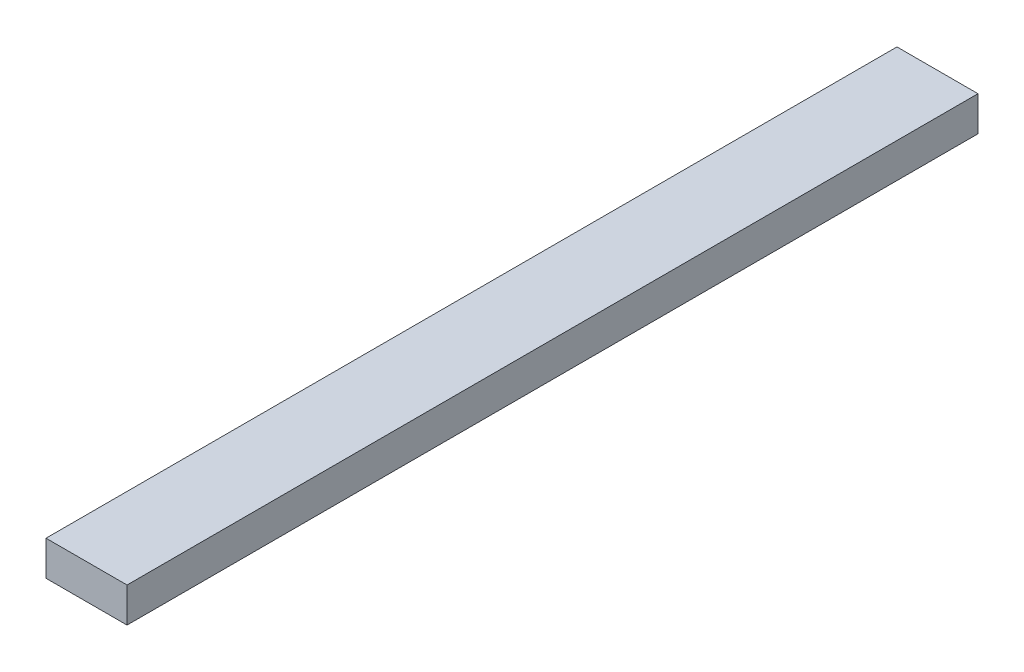
ISO-10303-21;
HEADER;
FILE_DESCRIPTION(('STEP AP214'),'2;1');
FILE_NAME('part.step','',(''),(''),'','','');
FILE_SCHEMA(('AUTOMOTIVE_DESIGN { 1 0 10303 214 1 1 1 1 }'));
ENDSEC;
DATA;
#1=APPLICATION_CONTEXT('core data for automotive mechanical design processes');
#2=APPLICATION_PROTOCOL_DEFINITION('international standard','automotive_design',2000,#1);
#3=PRODUCT_CONTEXT('',#1,'mechanical');
#4=PRODUCT('Part','Part','',(#3));
#5=PRODUCT_RELATED_PRODUCT_CATEGORY('part','',(#4));
#6=PRODUCT_DEFINITION_FORMATION('','',#4);
#7=PRODUCT_DEFINITION_CONTEXT('part definition',#1,'design');
#8=PRODUCT_DEFINITION('design','',#6,#7);
#9=PRODUCT_DEFINITION_SHAPE('','',#8);
#10=(LENGTH_UNIT() NAMED_UNIT(*) SI_UNIT(.MILLI.,.METRE.));
#11=(NAMED_UNIT(*) PLANE_ANGLE_UNIT() SI_UNIT($,.RADIAN.));
#12=(NAMED_UNIT(*) SI_UNIT($,.STERADIAN.) SOLID_ANGLE_UNIT());
#13=UNCERTAINTY_MEASURE_WITH_UNIT(LENGTH_MEASURE(1.E-05),#10,'distance_accuracy_value','');
#14=(GEOMETRIC_REPRESENTATION_CONTEXT(3) GLOBAL_UNCERTAINTY_ASSIGNED_CONTEXT((#13)) GLOBAL_UNIT_ASSIGNED_CONTEXT((#10,
#11,#12)) REPRESENTATION_CONTEXT('',''));
#15=CARTESIAN_POINT('',(0.,0.,0.));
#16=DIRECTION('',(0.,0.,1.));
#17=DIRECTION('',(1.,0.,0.));
#18=AXIS2_PLACEMENT_3D('',#15,#16,#17);
#19=CARTESIAN_POINT('',(-58.8507871435938,47.0280870609555,933.45));
#20=DIRECTION('',(1.,0.,0.));
#21=DIRECTION('',(0.,0.,-1.));
#22=AXIS2_PLACEMENT_3D('',#19,#20,#21);
#23=PLANE('',#22);
#24=DIRECTION('',(0.,-1.,0.));
#25=VECTOR('',#24,1.);
#26=CARTESIAN_POINT('',(-58.8507871435938,47.0280870609555,0.));
#27=LINE('',#26,#25);
#28=CARTESIAN_POINT('',(-58.8507871435938,47.0280870609555,0.));
#29=VERTEX_POINT('',#28);
#30=CARTESIAN_POINT('',(-58.8507871435938,8.92808706095547,0.));
#31=VERTEX_POINT('',#30);
#32=EDGE_CURVE('E95',#29,#31,#27,.T.);
#33=ORIENTED_EDGE('',*,*,#32,.T.);
#34=DIRECTION('',(0.,0.,-1.));
#35=VECTOR('',#34,1.);
#36=CARTESIAN_POINT('',(-58.8507871435938,8.92808706095547,933.45));
#37=LINE('',#36,#35);
#38=CARTESIAN_POINT('',(-58.8507871435938,8.92808706095547,933.45));
#39=VERTEX_POINT('',#38);
#40=EDGE_CURVE('E11',#39,#31,#37,.T.);
#41=ORIENTED_EDGE('',*,*,#40,.F.);
#42=DIRECTION('',(0.,-1.,0.));
#43=VECTOR('',#42,1.);
#44=CARTESIAN_POINT('',(-58.8507871435938,47.0280870609555,933.45));
#45=LINE('',#44,#43);
#46=CARTESIAN_POINT('',(-58.8507871435938,47.0280870609555,933.45));
#47=VERTEX_POINT('',#46);
#48=EDGE_CURVE('E83',#47,#39,#45,.T.);
#49=ORIENTED_EDGE('',*,*,#48,.F.);
#50=DIRECTION('',(0.,0.,-1.));
#51=VECTOR('',#50,1.);
#52=CARTESIAN_POINT('',(-58.8507871435938,47.0280870609555,933.45));
#53=LINE('',#52,#51);
#54=EDGE_CURVE('E91',#47,#29,#53,.T.);
#55=ORIENTED_EDGE('',*,*,#54,.T.);
#56=EDGE_LOOP('',(#33,#41,#49,#55));
#57=FACE_BOUND('',#56,.T.);
#58=ADVANCED_FACE('F32',(#57),#23,.F.);
#59=CARTESIAN_POINT('',(-58.8507871435938,8.92808706095547,933.45));
#60=DIRECTION('',(0.,1.,0.));
#61=DIRECTION('',(0.,0.,1.));
#62=AXIS2_PLACEMENT_3D('',#59,#60,#61);
#63=PLANE('',#62);
#64=DIRECTION('',(1.,0.,0.));
#65=VECTOR('',#64,1.);
#66=CARTESIAN_POINT('',(-58.8507871435938,8.92808706095547,0.));
#67=LINE('',#66,#65);
#68=CARTESIAN_POINT('',(30.0492128564062,8.92808706095547,0.));
#69=VERTEX_POINT('',#68);
#70=EDGE_CURVE('E87',#31,#69,#67,.T.);
#71=ORIENTED_EDGE('',*,*,#70,.T.);
#72=DIRECTION('',(0.,0.,-1.));
#73=VECTOR('',#72,1.);
#74=CARTESIAN_POINT('',(30.0492128564062,8.92808706095547,933.45));
#75=LINE('',#74,#73);
#76=CARTESIAN_POINT('',(30.0492128564062,8.92808706095547,933.45));
#77=VERTEX_POINT('',#76);
#78=EDGE_CURVE('E40',#77,#69,#75,.T.);
#79=ORIENTED_EDGE('',*,*,#78,.F.);
#80=DIRECTION('',(1.,0.,0.));
#81=VECTOR('',#80,1.);
#82=CARTESIAN_POINT('',(-58.8507871435938,8.92808706095547,933.45));
#83=LINE('',#82,#81);
#84=EDGE_CURVE('E78',#39,#77,#83,.T.);
#85=ORIENTED_EDGE('',*,*,#84,.F.);
#86=ORIENTED_EDGE('',*,*,#40,.T.);
#87=EDGE_LOOP('',(#71,#79,#85,#86));
#88=FACE_BOUND('',#87,.T.);
#89=ADVANCED_FACE('F86',(#88),#63,.F.);
#90=CARTESIAN_POINT('',(30.0492128564062,47.0280870609555,933.45));
#91=DIRECTION('',(-1.,0.,0.));
#92=DIRECTION('',(0.,0.,1.));
#93=AXIS2_PLACEMENT_3D('',#90,#91,#92);
#94=PLANE('',#93);
#95=DIRECTION('',(0.,1.,0.));
#96=VECTOR('',#95,1.);
#97=CARTESIAN_POINT('',(30.0492128564062,47.0280870609555,0.));
#98=LINE('',#97,#96);
#99=CARTESIAN_POINT('',(30.0492128564062,47.0280870609555,0.));
#100=VERTEX_POINT('',#99);
#101=EDGE_CURVE('E65',#69,#100,#98,.T.);
#102=ORIENTED_EDGE('',*,*,#101,.T.);
#103=DIRECTION('',(0.,0.,-1.));
#104=VECTOR('',#103,1.);
#105=CARTESIAN_POINT('',(30.0492128564062,47.0280870609555,933.45));
#106=LINE('',#105,#104);
#107=CARTESIAN_POINT('',(30.0492128564062,47.0280870609555,933.45));
#108=VERTEX_POINT('',#107);
#109=EDGE_CURVE('E88',#108,#100,#106,.T.);
#110=ORIENTED_EDGE('',*,*,#109,.F.);
#111=DIRECTION('',(0.,1.,0.));
#112=VECTOR('',#111,1.);
#113=CARTESIAN_POINT('',(30.0492128564062,47.0280870609555,933.45));
#114=LINE('',#113,#112);
#115=EDGE_CURVE('E81',#77,#108,#114,.T.);
#116=ORIENTED_EDGE('',*,*,#115,.F.);
#117=ORIENTED_EDGE('',*,*,#78,.T.);
#118=EDGE_LOOP('',(#102,#110,#116,#117));
#119=FACE_BOUND('',#118,.T.);
#120=ADVANCED_FACE('F89',(#119),#94,.F.);
#121=CARTESIAN_POINT('',(-58.8507871435938,47.0280870609555,933.45));
#122=DIRECTION('',(0.,-1.,0.));
#123=DIRECTION('',(0.,0.,-1.));
#124=AXIS2_PLACEMENT_3D('',#121,#122,#123);
#125=PLANE('',#124);
#126=DIRECTION('',(-1.,0.,0.));
#127=VECTOR('',#126,1.);
#128=CARTESIAN_POINT('',(-58.8507871435938,47.0280870609555,0.));
#129=LINE('',#128,#127);
#130=EDGE_CURVE('E71',#100,#29,#129,.T.);
#131=ORIENTED_EDGE('',*,*,#130,.T.);
#132=ORIENTED_EDGE('',*,*,#54,.F.);
#133=DIRECTION('',(-1.,0.,0.));
#134=VECTOR('',#133,1.);
#135=CARTESIAN_POINT('',(-58.8507871435938,47.0280870609555,933.45));
#136=LINE('',#135,#134);
#137=EDGE_CURVE('E48',#108,#47,#136,.T.);
#138=ORIENTED_EDGE('',*,*,#137,.F.);
#139=ORIENTED_EDGE('',*,*,#109,.T.);
#140=EDGE_LOOP('',(#131,#132,#138,#139));
#141=FACE_BOUND('',#140,.T.);
#142=ADVANCED_FACE('F102',(#141),#125,.F.);
#143=CARTESIAN_POINT('',(0.,0.,933.45));
#144=DIRECTION('',(0.,0.,1.));
#145=DIRECTION('',(1.,0.,0.));
#146=AXIS2_PLACEMENT_3D('',#143,#144,#145);
#147=PLANE('',#146);
#148=ORIENTED_EDGE('',*,*,#48,.T.);
#149=ORIENTED_EDGE('',*,*,#84,.T.);
#150=ORIENTED_EDGE('',*,*,#115,.T.);
#151=ORIENTED_EDGE('',*,*,#137,.T.);
#152=EDGE_LOOP('',(#148,#149,#150,#151));
#153=FACE_BOUND('',#152,.T.);
#154=ADVANCED_FACE('F79',(#153),#147,.T.);
#155=CARTESIAN_POINT('',(0.,0.,0.));
#156=DIRECTION('',(0.,0.,1.));
#157=DIRECTION('',(1.,0.,0.));
#158=AXIS2_PLACEMENT_3D('',#155,#156,#157);
#159=PLANE('',#158);
#160=ORIENTED_EDGE('',*,*,#32,.F.);
#161=ORIENTED_EDGE('',*,*,#130,.F.);
#162=ORIENTED_EDGE('',*,*,#101,.F.);
#163=ORIENTED_EDGE('',*,*,#70,.F.);
#164=EDGE_LOOP('',(#160,#161,#162,#163));
#165=FACE_BOUND('',#164,.T.);
#166=ADVANCED_FACE('F105',(#165),#159,.F.);
#167=CLOSED_SHELL('',(#58,#89,#120,#142,#154,#166));
#168=MANIFOLD_SOLID_BREP('B2',#167);
#169=ADVANCED_BREP_SHAPE_REPRESENTATION('',(#18,#168),#14);
#170=SHAPE_DEFINITION_REPRESENTATION(#9,#169);
ENDSEC;
END-ISO-10303-21;
